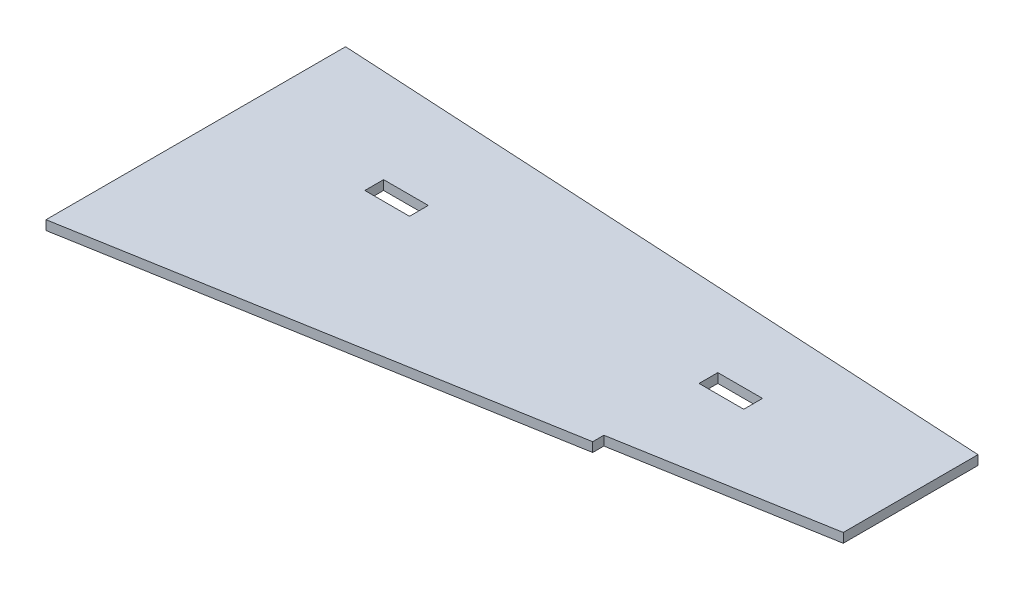
ISO-10303-21;
HEADER;
FILE_DESCRIPTION(('STEP AP214'),'2;1');
FILE_NAME('part.step','',(''),(''),'','','');
FILE_SCHEMA(('AUTOMOTIVE_DESIGN { 1 0 10303 214 1 1 1 1 }'));
ENDSEC;
DATA;
#1=APPLICATION_CONTEXT('core data for automotive mechanical design processes');
#2=APPLICATION_PROTOCOL_DEFINITION('international standard','automotive_design',2000,#1);
#3=PRODUCT_CONTEXT('',#1,'mechanical');
#4=PRODUCT('Part','Part','',(#3));
#5=PRODUCT_RELATED_PRODUCT_CATEGORY('part','',(#4));
#6=PRODUCT_DEFINITION_FORMATION('','',#4);
#7=PRODUCT_DEFINITION_CONTEXT('part definition',#1,'design');
#8=PRODUCT_DEFINITION('design','',#6,#7);
#9=PRODUCT_DEFINITION_SHAPE('','',#8);
#10=(LENGTH_UNIT() NAMED_UNIT(*) SI_UNIT(.MILLI.,.METRE.));
#11=(NAMED_UNIT(*) PLANE_ANGLE_UNIT() SI_UNIT($,.RADIAN.));
#12=(NAMED_UNIT(*) SI_UNIT($,.STERADIAN.) SOLID_ANGLE_UNIT());
#13=UNCERTAINTY_MEASURE_WITH_UNIT(LENGTH_MEASURE(1.E-05),#10,'distance_accuracy_value','');
#14=(GEOMETRIC_REPRESENTATION_CONTEXT(3) GLOBAL_UNCERTAINTY_ASSIGNED_CONTEXT((#13)) GLOBAL_UNIT_ASSIGNED_CONTEXT((#10,
#11,#12)) REPRESENTATION_CONTEXT('',''));
#15=CARTESIAN_POINT('',(0.,0.,0.));
#16=DIRECTION('',(0.,0.,1.));
#17=DIRECTION('',(1.,0.,0.));
#18=AXIS2_PLACEMENT_3D('',#15,#16,#17);
#19=CARTESIAN_POINT('',(264.564463463203,5.334,0.));
#20=DIRECTION('',(-1.,0.,0.));
#21=DIRECTION('',(0.,0.,1.));
#22=AXIS2_PLACEMENT_3D('',#19,#20,#21);
#23=PLANE('',#22);
#24=DIRECTION('',(0.,0.,-1.));
#25=VECTOR('',#24,1.);
#26=CARTESIAN_POINT('',(264.564463463203,0.,0.));
#27=LINE('',#26,#25);
#28=CARTESIAN_POINT('',(264.564463463203,0.,124.16008162896));
#29=VERTEX_POINT('',#28);
#30=CARTESIAN_POINT('',(264.564463463203,0.,117.81008162896));
#31=VERTEX_POINT('',#30);
#32=EDGE_CURVE('E204',#29,#31,#27,.T.);
#33=ORIENTED_EDGE('',*,*,#32,.T.);
#34=DIRECTION('',(0.,-1.,0.));
#35=VECTOR('',#34,1.);
#36=CARTESIAN_POINT('',(264.564463463203,5.334,117.81008162896));
#37=LINE('',#36,#35);
#38=CARTESIAN_POINT('',(264.564463463203,5.334,117.81008162896));
#39=VERTEX_POINT('',#38);
#40=EDGE_CURVE('E11',#39,#31,#37,.T.);
#41=ORIENTED_EDGE('',*,*,#40,.F.);
#42=DIRECTION('',(0.,0.,-1.));
#43=VECTOR('',#42,1.);
#44=CARTESIAN_POINT('',(264.564463463203,5.334,0.));
#45=LINE('',#44,#43);
#46=CARTESIAN_POINT('',(264.564463463203,5.334,124.16008162896));
#47=VERTEX_POINT('',#46);
#48=EDGE_CURVE('E205',#47,#39,#45,.T.);
#49=ORIENTED_EDGE('',*,*,#48,.F.);
#50=DIRECTION('',(0.,-1.,0.));
#51=VECTOR('',#50,1.);
#52=CARTESIAN_POINT('',(264.564463463203,5.334,124.16008162896));
#53=LINE('',#52,#51);
#54=EDGE_CURVE('E222',#47,#29,#53,.T.);
#55=ORIENTED_EDGE('',*,*,#54,.T.);
#56=EDGE_LOOP('',(#33,#41,#49,#55));
#57=FACE_BOUND('',#56,.T.);
#58=ADVANCED_FACE('F38',(#57),#23,.F.);
#59=CARTESIAN_POINT('',(27.7013255981864,5.334,159.061052803589));
#60=DIRECTION('',(-0.171572828941037,0.,-0.985171439075032));
#61=DIRECTION('',(-0.985171439075032,0.,0.171572828941037));
#62=AXIS2_PLACEMENT_3D('',#59,#60,#61);
#63=PLANE('',#62);
#64=DIRECTION('',(0.985171439075032,0.,-0.171572828941037));
#65=VECTOR('',#64,1.);
#66=CARTESIAN_POINT('',(27.7013255981864,0.,159.061052803589));
#67=LINE('',#66,#65);
#68=CARTESIAN_POINT('',(380.417035207962,0.,97.6337420742879));
#69=VERTEX_POINT('',#68);
#70=EDGE_CURVE('E225',#31,#69,#67,.T.);
#71=ORIENTED_EDGE('',*,*,#70,.T.);
#72=DIRECTION('',(0.,-1.,0.));
#73=VECTOR('',#72,1.);
#74=CARTESIAN_POINT('',(380.417035207962,5.334,97.6337420742879));
#75=LINE('',#74,#73);
#76=CARTESIAN_POINT('',(380.417035207962,5.334,97.6337420742879));
#77=VERTEX_POINT('',#76);
#78=EDGE_CURVE('E45',#77,#69,#75,.T.);
#79=ORIENTED_EDGE('',*,*,#78,.F.);
#80=DIRECTION('',(0.985171439075032,0.,-0.171572828941037));
#81=VECTOR('',#80,1.);
#82=CARTESIAN_POINT('',(27.7013255981864,5.334,159.061052803589));
#83=LINE('',#82,#81);
#84=EDGE_CURVE('E208',#39,#77,#83,.T.);
#85=ORIENTED_EDGE('',*,*,#84,.F.);
#86=ORIENTED_EDGE('',*,*,#40,.T.);
#87=EDGE_LOOP('',(#71,#79,#85,#86));
#88=FACE_BOUND('',#87,.T.);
#89=ADVANCED_FACE('F251',(#88),#63,.F.);
#90=CARTESIAN_POINT('',(380.417035207962,5.334,0.));
#91=DIRECTION('',(1.,0.,0.));
#92=DIRECTION('',(0.,0.,-1.));
#93=AXIS2_PLACEMENT_3D('',#90,#91,#92);
#94=PLANE('',#93);
#95=DIRECTION('',(0.,0.,1.));
#96=VECTOR('',#95,1.);
#97=CARTESIAN_POINT('',(380.417035207962,0.,0.));
#98=LINE('',#97,#96);
#99=CARTESIAN_POINT('',(380.417035207962,0.,21.0684437864845));
#100=VERTEX_POINT('',#99);
#101=EDGE_CURVE('E228',#100,#69,#98,.T.);
#102=ORIENTED_EDGE('',*,*,#101,.F.);
#103=DIRECTION('',(0.,-1.,0.));
#104=VECTOR('',#103,1.);
#105=CARTESIAN_POINT('',(380.417035207962,5.334,21.0684437864845));
#106=LINE('',#105,#104);
#107=CARTESIAN_POINT('',(380.417035207962,5.334,21.0684437864845));
#108=VERTEX_POINT('',#107);
#109=EDGE_CURVE('E244',#108,#100,#106,.T.);
#110=ORIENTED_EDGE('',*,*,#109,.F.);
#111=DIRECTION('',(0.,0.,1.));
#112=VECTOR('',#111,1.);
#113=CARTESIAN_POINT('',(380.417035207962,5.334,0.));
#114=LINE('',#113,#112);
#115=EDGE_CURVE('E211',#108,#77,#114,.T.);
#116=ORIENTED_EDGE('',*,*,#115,.T.);
#117=ORIENTED_EDGE('',*,*,#78,.T.);
#118=EDGE_LOOP('',(#102,#110,#116,#117));
#119=FACE_BOUND('',#118,.T.);
#120=ADVANCED_FACE('F248',(#119),#94,.T.);
#121=CARTESIAN_POINT('',(0.,5.334,0.));
#122=DIRECTION('',(0.0552977527204317,0.,-0.998469908682315));
#123=DIRECTION('',(-0.998469908682315,0.,-0.0552977527204317));
#124=AXIS2_PLACEMENT_3D('',#121,#122,#123);
#125=PLANE('',#124);
#126=DIRECTION('',(0.998469908682315,0.,0.0552977527204317));
#127=VECTOR('',#126,1.);
#128=CARTESIAN_POINT('',(0.,0.,0.));
#129=LINE('',#128,#127);
#130=CARTESIAN_POINT('',(0.,0.,0.));
#131=VERTEX_POINT('',#130);
#132=EDGE_CURVE('E231',#131,#100,#129,.T.);
#133=ORIENTED_EDGE('',*,*,#132,.F.);
#134=DIRECTION('',(0.,-1.,0.));
#135=VECTOR('',#134,1.);
#136=CARTESIAN_POINT('',(0.,5.334,0.));
#137=LINE('',#136,#135);
#138=CARTESIAN_POINT('',(0.,5.334,0.));
#139=VERTEX_POINT('',#138);
#140=EDGE_CURVE('E242',#139,#131,#137,.T.);
#141=ORIENTED_EDGE('',*,*,#140,.F.);
#142=DIRECTION('',(0.998469908682315,0.,0.0552977527204317));
#143=VECTOR('',#142,1.);
#144=CARTESIAN_POINT('',(0.,5.334,0.));
#145=LINE('',#144,#143);
#146=EDGE_CURVE('E214',#139,#108,#145,.T.);
#147=ORIENTED_EDGE('',*,*,#146,.T.);
#148=ORIENTED_EDGE('',*,*,#109,.T.);
#149=EDGE_LOOP('',(#133,#141,#147,#148));
#150=FACE_BOUND('',#149,.T.);
#151=ADVANCED_FACE('F259',(#150),#125,.T.);
#152=CARTESIAN_POINT('',(0.,5.334,0.));
#153=DIRECTION('',(1.,0.,0.));
#154=DIRECTION('',(0.,0.,-1.));
#155=AXIS2_PLACEMENT_3D('',#152,#153,#154);
#156=PLANE('',#155);
#157=DIRECTION('',(0.,0.,1.));
#158=VECTOR('',#157,1.);
#159=CARTESIAN_POINT('',(0.,0.,0.));
#160=LINE('',#159,#158);
#161=CARTESIAN_POINT('',(0.,0.,170.235385513396));
#162=VERTEX_POINT('',#161);
#163=EDGE_CURVE('E234',#131,#162,#160,.T.);
#164=ORIENTED_EDGE('',*,*,#163,.T.);
#165=DIRECTION('',(0.,-1.,0.));
#166=VECTOR('',#165,1.);
#167=CARTESIAN_POINT('',(0.,5.334,170.235385513396));
#168=LINE('',#167,#166);
#169=CARTESIAN_POINT('',(0.,5.334,170.235385513396));
#170=VERTEX_POINT('',#169);
#171=EDGE_CURVE('E240',#170,#162,#168,.T.);
#172=ORIENTED_EDGE('',*,*,#171,.F.);
#173=DIRECTION('',(0.,0.,1.));
#174=VECTOR('',#173,1.);
#175=CARTESIAN_POINT('',(0.,5.334,0.));
#176=LINE('',#175,#174);
#177=EDGE_CURVE('E217',#139,#170,#176,.T.);
#178=ORIENTED_EDGE('',*,*,#177,.F.);
#179=ORIENTED_EDGE('',*,*,#140,.T.);
#180=EDGE_LOOP('',(#164,#172,#178,#179));
#181=FACE_BOUND('',#180,.T.);
#182=ADVANCED_FACE('F271',(#181),#156,.F.);
#183=CARTESIAN_POINT('',(28.7746575307284,5.334,165.224126357333));
#184=DIRECTION('',(0.171572828941037,0.,0.985171439075032));
#185=DIRECTION('',(0.985171439075032,0.,-0.171572828941037));
#186=AXIS2_PLACEMENT_3D('',#183,#184,#185);
#187=PLANE('',#186);
#188=DIRECTION('',(-0.985171439075032,0.,0.171572828941037));
#189=VECTOR('',#188,1.);
#190=CARTESIAN_POINT('',(28.7746575307284,0.,165.224126357333));
#191=LINE('',#190,#189);
#192=EDGE_CURVE('E209',#29,#162,#191,.T.);
#193=ORIENTED_EDGE('',*,*,#192,.F.);
#194=ORIENTED_EDGE('',*,*,#54,.F.);
#195=DIRECTION('',(-0.985171439075032,0.,0.171572828941037));
#196=VECTOR('',#195,1.);
#197=CARTESIAN_POINT('',(28.7746575307284,5.334,165.224126357333));
#198=LINE('',#197,#196);
#199=EDGE_CURVE('E219',#47,#170,#198,.T.);
#200=ORIENTED_EDGE('',*,*,#199,.T.);
#201=ORIENTED_EDGE('',*,*,#171,.T.);
#202=EDGE_LOOP('',(#193,#194,#200,#201));
#203=FACE_BOUND('',#202,.T.);
#204=ADVANCED_FACE('F268',(#203),#187,.T.);
#205=CARTESIAN_POINT('',(0.,5.334,0.));
#206=DIRECTION('',(0.,1.,0.));
#207=DIRECTION('',(0.,0.,1.));
#208=AXIS2_PLACEMENT_3D('',#205,#206,#207);
#209=PLANE('',#208);
#210=DIRECTION('',(1.,0.,0.));
#211=VECTOR('',#210,1.);
#212=CARTESIAN_POINT('',(76.1999999999993,5.334,54.6115268567689));
#213=LINE('',#212,#211);
#214=CARTESIAN_POINT('',(76.1999999999993,5.334,54.6115268567689));
#215=VERTEX_POINT('',#214);
#216=CARTESIAN_POINT('',(101.599999999999,5.334,54.6115268567689));
#217=VERTEX_POINT('',#216);
#218=EDGE_CURVE('E148',#215,#217,#213,.T.);
#219=ORIENTED_EDGE('',*,*,#218,.T.);
#220=DIRECTION('',(0.,0.,1.));
#221=VECTOR('',#220,1.);
#222=CARTESIAN_POINT('',(101.599999999999,5.334,54.6115268567689));
#223=LINE('',#222,#221);
#224=CARTESIAN_POINT('',(101.599999999999,5.334,65.2795268567689));
#225=VERTEX_POINT('',#224);
#226=EDGE_CURVE('E137',#217,#225,#223,.T.);
#227=ORIENTED_EDGE('',*,*,#226,.T.);
#228=DIRECTION('',(-1.,0.,0.));
#229=VECTOR('',#228,1.);
#230=CARTESIAN_POINT('',(101.599999999999,5.334,65.2795268567689));
#231=LINE('',#230,#229);
#232=CARTESIAN_POINT('',(76.1999999999993,5.334,65.2795268567689));
#233=VERTEX_POINT('',#232);
#234=EDGE_CURVE('E159',#225,#233,#231,.T.);
#235=ORIENTED_EDGE('',*,*,#234,.T.);
#236=DIRECTION('',(0.,0.,-1.));
#237=VECTOR('',#236,1.);
#238=CARTESIAN_POINT('',(76.1999999999993,5.334,65.2795268567689));
#239=LINE('',#238,#237);
#240=EDGE_CURVE('E155',#233,#215,#239,.T.);
#241=ORIENTED_EDGE('',*,*,#240,.T.);
#242=EDGE_LOOP('',(#219,#227,#235,#241));
#243=FACE_BOUND('',#242,.T.);
#244=DIRECTION('',(1.,0.,0.));
#245=VECTOR('',#244,1.);
#246=CARTESIAN_POINT('',(266.117035207962,5.334,54.6115268567689));
#247=LINE('',#246,#245);
#248=CARTESIAN_POINT('',(266.117035207962,5.334,54.6115268567689));
#249=VERTEX_POINT('',#248);
#250=CARTESIAN_POINT('',(291.517035207962,5.334,54.6115268567689));
#251=VERTEX_POINT('',#250);
#252=EDGE_CURVE('E178',#249,#251,#247,.T.);
#253=ORIENTED_EDGE('',*,*,#252,.T.);
#254=DIRECTION('',(0.,0.,1.));
#255=VECTOR('',#254,1.);
#256=CARTESIAN_POINT('',(291.517035207962,5.334,54.6115268567689));
#257=LINE('',#256,#255);
#258=CARTESIAN_POINT('',(291.517035207962,5.334,65.2795268567689));
#259=VERTEX_POINT('',#258);
#260=EDGE_CURVE('E195',#251,#259,#257,.T.);
#261=ORIENTED_EDGE('',*,*,#260,.T.);
#262=DIRECTION('',(-1.,0.,0.));
#263=VECTOR('',#262,1.);
#264=CARTESIAN_POINT('',(291.517035207962,5.334,65.2795268567689));
#265=LINE('',#264,#263);
#266=CARTESIAN_POINT('',(266.117035207962,5.334,65.2795268567689));
#267=VERTEX_POINT('',#266);
#268=EDGE_CURVE('E144',#259,#267,#265,.T.);
#269=ORIENTED_EDGE('',*,*,#268,.T.);
#270=DIRECTION('',(0.,0.,-1.));
#271=VECTOR('',#270,1.);
#272=CARTESIAN_POINT('',(266.117035207962,5.334,65.2795268567689));
#273=LINE('',#272,#271);
#274=EDGE_CURVE('E175',#267,#249,#273,.T.);
#275=ORIENTED_EDGE('',*,*,#274,.T.);
#276=EDGE_LOOP('',(#253,#261,#269,#275));
#277=FACE_BOUND('',#276,.T.);
#278=ORIENTED_EDGE('',*,*,#48,.T.);
#279=ORIENTED_EDGE('',*,*,#84,.T.);
#280=ORIENTED_EDGE('',*,*,#115,.F.);
#281=ORIENTED_EDGE('',*,*,#146,.F.);
#282=ORIENTED_EDGE('',*,*,#177,.T.);
#283=ORIENTED_EDGE('',*,*,#199,.F.);
#284=EDGE_LOOP('',(#278,#279,#280,#281,#282,#283));
#285=FACE_BOUND('',#284,.T.);
#286=ADVANCED_FACE('F153',(#243,#277,#285),#209,.T.);
#287=CARTESIAN_POINT('',(0.,0.,0.));
#288=DIRECTION('',(0.,1.,0.));
#289=DIRECTION('',(0.,0.,1.));
#290=AXIS2_PLACEMENT_3D('',#287,#288,#289);
#291=PLANE('',#290);
#292=DIRECTION('',(0.,0.,1.));
#293=VECTOR('',#292,1.);
#294=CARTESIAN_POINT('',(101.599999999999,0.,54.6115268567689));
#295=LINE('',#294,#293);
#296=CARTESIAN_POINT('',(101.599999999999,0.,54.6115268567689));
#297=VERTEX_POINT('',#296);
#298=CARTESIAN_POINT('',(101.599999999999,0.,65.2795268567689));
#299=VERTEX_POINT('',#298);
#300=EDGE_CURVE('E157',#297,#299,#295,.T.);
#301=ORIENTED_EDGE('',*,*,#300,.F.);
#302=DIRECTION('',(1.,0.,0.));
#303=VECTOR('',#302,1.);
#304=CARTESIAN_POINT('',(76.1999999999993,0.,54.6115268567689));
#305=LINE('',#304,#303);
#306=CARTESIAN_POINT('',(76.1999999999993,0.,54.6115268567689));
#307=VERTEX_POINT('',#306);
#308=EDGE_CURVE('E60',#307,#297,#305,.T.);
#309=ORIENTED_EDGE('',*,*,#308,.F.);
#310=DIRECTION('',(0.,0.,-1.));
#311=VECTOR('',#310,1.);
#312=CARTESIAN_POINT('',(76.1999999999993,0.,65.2795268567689));
#313=LINE('',#312,#311);
#314=CARTESIAN_POINT('',(76.1999999999993,0.,65.2795268567689));
#315=VERTEX_POINT('',#314);
#316=EDGE_CURVE('E150',#315,#307,#313,.T.);
#317=ORIENTED_EDGE('',*,*,#316,.F.);
#318=DIRECTION('',(-1.,0.,0.));
#319=VECTOR('',#318,1.);
#320=CARTESIAN_POINT('',(101.599999999999,0.,65.2795268567689));
#321=LINE('',#320,#319);
#322=EDGE_CURVE('E164',#299,#315,#321,.T.);
#323=ORIENTED_EDGE('',*,*,#322,.F.);
#324=EDGE_LOOP('',(#301,#309,#317,#323));
#325=FACE_BOUND('',#324,.T.);
#326=DIRECTION('',(0.,0.,1.));
#327=VECTOR('',#326,1.);
#328=CARTESIAN_POINT('',(291.517035207962,0.,54.6115268567689));
#329=LINE('',#328,#327);
#330=CARTESIAN_POINT('',(291.517035207962,0.,54.6115268567689));
#331=VERTEX_POINT('',#330);
#332=CARTESIAN_POINT('',(291.517035207962,0.,65.2795268567689));
#333=VERTEX_POINT('',#332);
#334=EDGE_CURVE('E183',#331,#333,#329,.T.);
#335=ORIENTED_EDGE('',*,*,#334,.F.);
#336=DIRECTION('',(1.,0.,0.));
#337=VECTOR('',#336,1.);
#338=CARTESIAN_POINT('',(266.117035207962,0.,54.6115268567689));
#339=LINE('',#338,#337);
#340=CARTESIAN_POINT('',(266.117035207962,0.,54.6115268567689));
#341=VERTEX_POINT('',#340);
#342=EDGE_CURVE('E181',#341,#331,#339,.T.);
#343=ORIENTED_EDGE('',*,*,#342,.F.);
#344=DIRECTION('',(0.,0.,-1.));
#345=VECTOR('',#344,1.);
#346=CARTESIAN_POINT('',(266.117035207962,0.,65.2795268567689));
#347=LINE('',#346,#345);
#348=CARTESIAN_POINT('',(266.117035207962,0.,65.2795268567689));
#349=VERTEX_POINT('',#348);
#350=EDGE_CURVE('E189',#349,#341,#347,.T.);
#351=ORIENTED_EDGE('',*,*,#350,.F.);
#352=DIRECTION('',(-1.,0.,0.));
#353=VECTOR('',#352,1.);
#354=CARTESIAN_POINT('',(291.517035207962,0.,65.2795268567689));
#355=LINE('',#354,#353);
#356=EDGE_CURVE('E186',#333,#349,#355,.T.);
#357=ORIENTED_EDGE('',*,*,#356,.F.);
#358=EDGE_LOOP('',(#335,#343,#351,#357));
#359=FACE_BOUND('',#358,.T.);
#360=ORIENTED_EDGE('',*,*,#32,.F.);
#361=ORIENTED_EDGE('',*,*,#192,.T.);
#362=ORIENTED_EDGE('',*,*,#163,.F.);
#363=ORIENTED_EDGE('',*,*,#132,.T.);
#364=ORIENTED_EDGE('',*,*,#101,.T.);
#365=ORIENTED_EDGE('',*,*,#70,.F.);
#366=EDGE_LOOP('',(#360,#361,#362,#363,#364,#365));
#367=FACE_BOUND('',#366,.T.);
#368=ADVANCED_FACE('F255',(#325,#359,#367),#291,.F.);
#369=CARTESIAN_POINT('',(266.117035207962,5.335,54.6115268567689));
#370=DIRECTION('',(0.,0.,-1.));
#371=DIRECTION('',(-1.,0.,0.));
#372=AXIS2_PLACEMENT_3D('',#369,#370,#371);
#373=PLANE('',#372);
#374=DIRECTION('',(0.,-1.,0.));
#375=VECTOR('',#374,1.);
#376=CARTESIAN_POINT('',(266.117035207962,5.335,54.6115268567689));
#377=LINE('',#376,#375);
#378=EDGE_CURVE('E193',#249,#341,#377,.T.);
#379=ORIENTED_EDGE('',*,*,#378,.T.);
#380=ORIENTED_EDGE('',*,*,#342,.T.);
#381=DIRECTION('',(0.,-1.,0.));
#382=VECTOR('',#381,1.);
#383=CARTESIAN_POINT('',(291.517035207962,5.335,54.6115268567689));
#384=LINE('',#383,#382);
#385=EDGE_CURVE('E192',#251,#331,#384,.T.);
#386=ORIENTED_EDGE('',*,*,#385,.F.);
#387=ORIENTED_EDGE('',*,*,#252,.F.);
#388=EDGE_LOOP('',(#379,#380,#386,#387));
#389=FACE_BOUND('',#388,.T.);
#390=ADVANCED_FACE('F321',(#389),#373,.F.);
#391=CARTESIAN_POINT('',(266.117035207962,5.335,65.2795268567689));
#392=DIRECTION('',(-1.,0.,0.));
#393=DIRECTION('',(0.,0.,1.));
#394=AXIS2_PLACEMENT_3D('',#391,#392,#393);
#395=PLANE('',#394);
#396=DIRECTION('',(0.,-1.,0.));
#397=VECTOR('',#396,1.);
#398=CARTESIAN_POINT('',(266.117035207962,5.335,65.2795268567689));
#399=LINE('',#398,#397);
#400=EDGE_CURVE('E196',#267,#349,#399,.T.);
#401=ORIENTED_EDGE('',*,*,#400,.T.);
#402=ORIENTED_EDGE('',*,*,#350,.T.);
#403=ORIENTED_EDGE('',*,*,#378,.F.);
#404=ORIENTED_EDGE('',*,*,#274,.F.);
#405=EDGE_LOOP('',(#401,#402,#403,#404));
#406=FACE_BOUND('',#405,.T.);
#407=ADVANCED_FACE('F331',(#406),#395,.F.);
#408=CARTESIAN_POINT('',(291.517035207962,5.335,65.2795268567689));
#409=DIRECTION('',(0.,0.,1.));
#410=DIRECTION('',(1.,0.,0.));
#411=AXIS2_PLACEMENT_3D('',#408,#409,#410);
#412=PLANE('',#411);
#413=DIRECTION('',(0.,-1.,0.));
#414=VECTOR('',#413,1.);
#415=CARTESIAN_POINT('',(291.517035207962,5.335,65.2795268567689));
#416=LINE('',#415,#414);
#417=EDGE_CURVE('E198',#259,#333,#416,.T.);
#418=ORIENTED_EDGE('',*,*,#417,.T.);
#419=ORIENTED_EDGE('',*,*,#356,.T.);
#420=ORIENTED_EDGE('',*,*,#400,.F.);
#421=ORIENTED_EDGE('',*,*,#268,.F.);
#422=EDGE_LOOP('',(#418,#419,#420,#421));
#423=FACE_BOUND('',#422,.T.);
#424=ADVANCED_FACE('F341',(#423),#412,.F.);
#425=CARTESIAN_POINT('',(291.517035207962,5.335,54.6115268567689));
#426=DIRECTION('',(1.,0.,0.));
#427=DIRECTION('',(0.,0.,-1.));
#428=AXIS2_PLACEMENT_3D('',#425,#426,#427);
#429=PLANE('',#428);
#430=ORIENTED_EDGE('',*,*,#385,.T.);
#431=ORIENTED_EDGE('',*,*,#334,.T.);
#432=ORIENTED_EDGE('',*,*,#417,.F.);
#433=ORIENTED_EDGE('',*,*,#260,.F.);
#434=EDGE_LOOP('',(#430,#431,#432,#433));
#435=FACE_BOUND('',#434,.T.);
#436=ADVANCED_FACE('F351',(#435),#429,.F.);
#437=CARTESIAN_POINT('',(76.1999999999993,5.335,54.6115268567689));
#438=DIRECTION('',(0.,0.,-1.));
#439=DIRECTION('',(-1.,0.,0.));
#440=AXIS2_PLACEMENT_3D('',#437,#438,#439);
#441=PLANE('',#440);
#442=DIRECTION('',(0.,-1.,0.));
#443=VECTOR('',#442,1.);
#444=CARTESIAN_POINT('',(76.1999999999993,5.335,54.6115268567689));
#445=LINE('',#444,#443);
#446=EDGE_CURVE('E145',#215,#307,#445,.T.);
#447=ORIENTED_EDGE('',*,*,#446,.T.);
#448=ORIENTED_EDGE('',*,*,#308,.T.);
#449=DIRECTION('',(0.,-1.,0.));
#450=VECTOR('',#449,1.);
#451=CARTESIAN_POINT('',(101.599999999999,5.335,54.6115268567689));
#452=LINE('',#451,#450);
#453=EDGE_CURVE('E139',#217,#297,#452,.T.);
#454=ORIENTED_EDGE('',*,*,#453,.F.);
#455=ORIENTED_EDGE('',*,*,#218,.F.);
#456=EDGE_LOOP('',(#447,#448,#454,#455));
#457=FACE_BOUND('',#456,.T.);
#458=ADVANCED_FACE('F147',(#457),#441,.F.);
#459=CARTESIAN_POINT('',(76.1999999999993,5.335,65.2795268567689));
#460=DIRECTION('',(-1.,0.,0.));
#461=DIRECTION('',(0.,0.,1.));
#462=AXIS2_PLACEMENT_3D('',#459,#460,#461);
#463=PLANE('',#462);
#464=DIRECTION('',(0.,-1.,0.));
#465=VECTOR('',#464,1.);
#466=CARTESIAN_POINT('',(76.1999999999993,5.335,65.2795268567689));
#467=LINE('',#466,#465);
#468=EDGE_CURVE('E170',#233,#315,#467,.T.);
#469=ORIENTED_EDGE('',*,*,#468,.T.);
#470=ORIENTED_EDGE('',*,*,#316,.T.);
#471=ORIENTED_EDGE('',*,*,#446,.F.);
#472=ORIENTED_EDGE('',*,*,#240,.F.);
#473=EDGE_LOOP('',(#469,#470,#471,#472));
#474=FACE_BOUND('',#473,.T.);
#475=ADVANCED_FACE('F370',(#474),#463,.F.);
#476=CARTESIAN_POINT('',(101.599999999999,5.335,65.2795268567689));
#477=DIRECTION('',(0.,0.,1.));
#478=DIRECTION('',(1.,0.,0.));
#479=AXIS2_PLACEMENT_3D('',#476,#477,#478);
#480=PLANE('',#479);
#481=DIRECTION('',(0.,-1.,0.));
#482=VECTOR('',#481,1.);
#483=CARTESIAN_POINT('',(101.599999999999,5.335,65.2795268567689));
#484=LINE('',#483,#482);
#485=EDGE_CURVE('E52',#225,#299,#484,.T.);
#486=ORIENTED_EDGE('',*,*,#485,.T.);
#487=ORIENTED_EDGE('',*,*,#322,.T.);
#488=ORIENTED_EDGE('',*,*,#468,.F.);
#489=ORIENTED_EDGE('',*,*,#234,.F.);
#490=EDGE_LOOP('',(#486,#487,#488,#489));
#491=FACE_BOUND('',#490,.T.);
#492=ADVANCED_FACE('F379',(#491),#480,.F.);
#493=CARTESIAN_POINT('',(101.599999999999,5.335,54.6115268567689));
#494=DIRECTION('',(1.,0.,0.));
#495=DIRECTION('',(0.,0.,-1.));
#496=AXIS2_PLACEMENT_3D('',#493,#494,#495);
#497=PLANE('',#496);
#498=ORIENTED_EDGE('',*,*,#453,.T.);
#499=ORIENTED_EDGE('',*,*,#300,.T.);
#500=ORIENTED_EDGE('',*,*,#485,.F.);
#501=ORIENTED_EDGE('',*,*,#226,.F.);
#502=EDGE_LOOP('',(#498,#499,#500,#501));
#503=FACE_BOUND('',#502,.T.);
#504=ADVANCED_FACE('F138',(#503),#497,.F.);
#505=CLOSED_SHELL('',(#58,#89,#120,#151,#182,#204,#286,#368,#390,#407,#424,#436,#458,#475,#492,#504));
#506=MANIFOLD_SOLID_BREP('B2',#505);
#507=ADVANCED_BREP_SHAPE_REPRESENTATION('',(#18,#506),#14);
#508=SHAPE_DEFINITION_REPRESENTATION(#9,#507);
ENDSEC;
END-ISO-10303-21;
